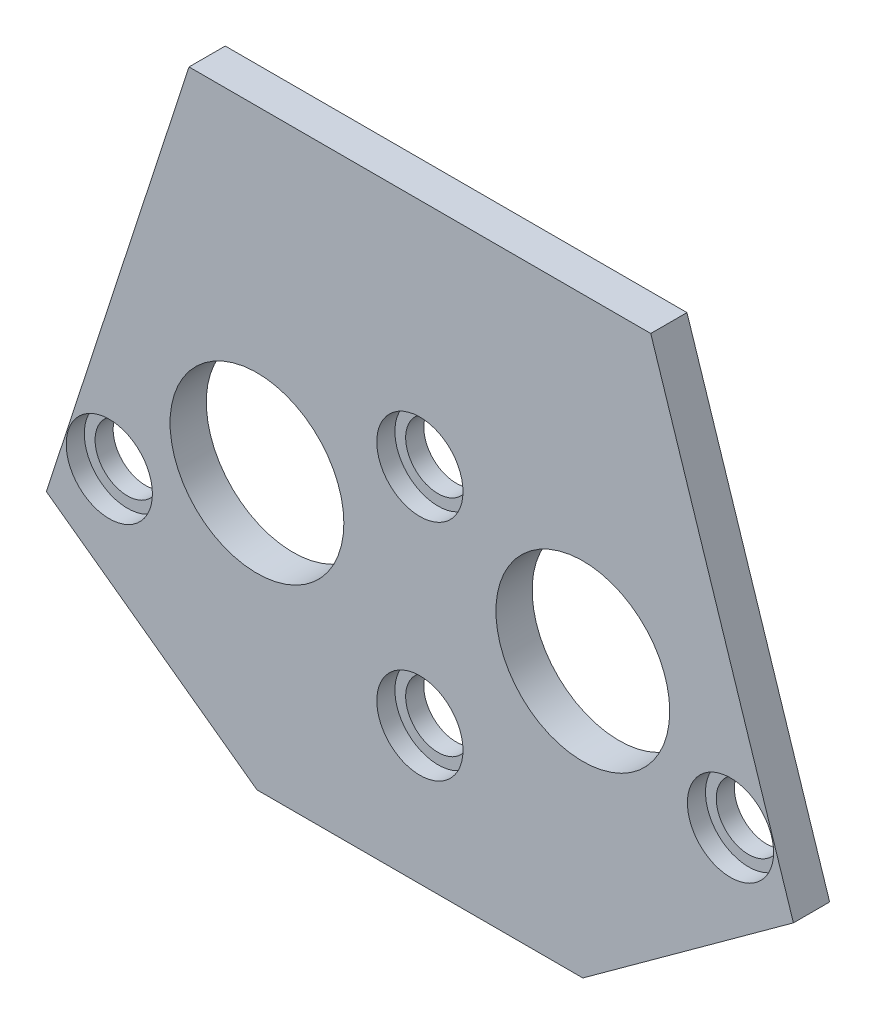
ISO-10303-21;
HEADER;
FILE_DESCRIPTION(('STEP AP214'),'2;1');
FILE_NAME('part.step','',(''),(''),'','','');
FILE_SCHEMA(('AUTOMOTIVE_DESIGN { 1 0 10303 214 1 1 1 1 }'));
ENDSEC;
DATA;
#1=APPLICATION_CONTEXT('core data for automotive mechanical design processes');
#2=APPLICATION_PROTOCOL_DEFINITION('international standard','automotive_design',2000,#1);
#3=PRODUCT_CONTEXT('',#1,'mechanical');
#4=PRODUCT('Part','Part','',(#3));
#5=PRODUCT_RELATED_PRODUCT_CATEGORY('part','',(#4));
#6=PRODUCT_DEFINITION_FORMATION('','',#4);
#7=PRODUCT_DEFINITION_CONTEXT('part definition',#1,'design');
#8=PRODUCT_DEFINITION('design','',#6,#7);
#9=PRODUCT_DEFINITION_SHAPE('','',#8);
#10=(LENGTH_UNIT() NAMED_UNIT(*) SI_UNIT(.MILLI.,.METRE.));
#11=(NAMED_UNIT(*) PLANE_ANGLE_UNIT() SI_UNIT($,.RADIAN.));
#12=(NAMED_UNIT(*) SI_UNIT($,.STERADIAN.) SOLID_ANGLE_UNIT());
#13=UNCERTAINTY_MEASURE_WITH_UNIT(LENGTH_MEASURE(1.E-05),#10,'distance_accuracy_value','');
#14=(GEOMETRIC_REPRESENTATION_CONTEXT(3) GLOBAL_UNCERTAINTY_ASSIGNED_CONTEXT((#13)) GLOBAL_UNIT_ASSIGNED_CONTEXT((#10,
#11,#12)) REPRESENTATION_CONTEXT('',''));
#15=CARTESIAN_POINT('',(0.,0.,0.));
#16=DIRECTION('',(0.,0.,1.));
#17=DIRECTION('',(1.,0.,0.));
#18=AXIS2_PLACEMENT_3D('',#15,#16,#17);
#19=CARTESIAN_POINT('',(0.,0.,5.334));
#20=DIRECTION('',(0.,0.,-1.));
#21=DIRECTION('',(-1.,0.,0.));
#22=AXIS2_PLACEMENT_3D('',#19,#20,#21);
#23=CYLINDRICAL_SURFACE('',#22,4.76250000000001);
#24=CARTESIAN_POINT('',(0.,0.,0.));
#25=DIRECTION('',(0.,0.,1.));
#26=DIRECTION('',(1.,0.,0.));
#27=AXIS2_PLACEMENT_3D('',#24,#25,#26);
#28=CIRCLE('',#27,4.76250000000001);
#29=CARTESIAN_POINT('',(4.76250000000001,0.,0.));
#30=VERTEX_POINT('',#29);
#31=EDGE_CURVE('E126',#30,#30,#28,.T.);
#32=ORIENTED_EDGE('',*,*,#31,.F.);
#33=EDGE_LOOP('',(#32));
#34=FACE_BOUND('',#33,.T.);
#35=CARTESIAN_POINT('',(0.,0.,2.667));
#36=DIRECTION('',(0.,0.,1.));
#37=DIRECTION('',(1.,0.,0.));
#38=AXIS2_PLACEMENT_3D('',#35,#36,#37);
#39=CIRCLE('',#38,4.7625);
#40=CARTESIAN_POINT('',(4.7625,0.,2.667));
#41=VERTEX_POINT('',#40);
#42=EDGE_CURVE('E267',#41,#41,#39,.T.);
#43=ORIENTED_EDGE('',*,*,#42,.T.);
#44=EDGE_LOOP('',(#43));
#45=FACE_BOUND('',#44,.T.);
#46=ADVANCED_FACE('F34',(#34,#45),#23,.F.);
#47=CARTESIAN_POINT('',(-50.4535452255246,16.3933505885501,5.334));
#48=DIRECTION('',(0.951056516295157,-0.309016994374938,0.));
#49=DIRECTION('',(0.309016994374938,0.951056516295157,0.));
#50=AXIS2_PLACEMENT_3D('',#47,#48,#49);
#51=PLANE('',#50);
#52=DIRECTION('',(-0.309016994374938,-0.951056516295157,0.));
#53=VECTOR('',#52,1.);
#54=CARTESIAN_POINT('',(-50.4535452255246,16.3933505885501,0.));
#55=LINE('',#54,#53);
#56=CARTESIAN_POINT('',(-34.0059481811678,67.0138492380612,0.));
#57=VERTEX_POINT('',#56);
#58=CARTESIAN_POINT('',(-55.0227799767962,2.33069201707196,0.));
#59=VERTEX_POINT('',#58);
#60=EDGE_CURVE('E129',#57,#59,#55,.T.);
#61=ORIENTED_EDGE('',*,*,#60,.T.);
#62=DIRECTION('',(0.,0.,-1.));
#63=VECTOR('',#62,1.);
#64=CARTESIAN_POINT('',(-55.0227799767962,2.33069201707196,5.334));
#65=LINE('',#64,#63);
#66=CARTESIAN_POINT('',(-55.0227799767962,2.33069201707196,5.334));
#67=VERTEX_POINT('',#66);
#68=EDGE_CURVE('E11',#67,#59,#65,.T.);
#69=ORIENTED_EDGE('',*,*,#68,.F.);
#70=DIRECTION('',(-0.309016994374938,-0.951056516295157,0.));
#71=VECTOR('',#70,1.);
#72=CARTESIAN_POINT('',(-50.4535452255246,16.3933505885501,5.334));
#73=LINE('',#72,#71);
#74=CARTESIAN_POINT('',(-34.0059481811678,67.0138492380612,5.334));
#75=VERTEX_POINT('',#74);
#76=EDGE_CURVE('E153',#75,#67,#73,.T.);
#77=ORIENTED_EDGE('',*,*,#76,.F.);
#78=DIRECTION('',(0.,0.,-1.));
#79=VECTOR('',#78,1.);
#80=CARTESIAN_POINT('',(-34.0059481811678,67.0138492380612,5.334));
#81=LINE('',#80,#79);
#82=EDGE_CURVE('E115',#75,#57,#81,.T.);
#83=ORIENTED_EDGE('',*,*,#82,.T.);
#84=EDGE_LOOP('',(#61,#69,#77,#83));
#85=FACE_BOUND('',#84,.T.);
#86=ADVANCED_FACE('F151',(#85),#51,.F.);
#87=CARTESIAN_POINT('',(-17.9015930279491,-24.6394289913025,5.334));
#88=DIRECTION('',(0.587785252292465,0.809016994374953,0.));
#89=DIRECTION('',(-0.809016994374953,0.587785252292465,0.));
#90=AXIS2_PLACEMENT_3D('',#87,#88,#89);
#91=PLANE('',#90);
#92=DIRECTION('',(0.809016994374953,-0.587785252292465,0.));
#93=VECTOR('',#92,1.);
#94=CARTESIAN_POINT('',(-17.9015930279491,-24.6394289913025,0.));
#95=LINE('',#94,#93);
#96=CARTESIAN_POINT('',(-24.,-20.2086769730233,0.));
#97=VERTEX_POINT('',#96);
#98=EDGE_CURVE('E132',#59,#97,#95,.T.);
#99=ORIENTED_EDGE('',*,*,#98,.T.);
#100=DIRECTION('',(0.,0.,-1.));
#101=VECTOR('',#100,1.);
#102=CARTESIAN_POINT('',(-24.,-20.2086769730233,5.334));
#103=LINE('',#102,#101);
#104=CARTESIAN_POINT('',(-24.,-20.2086769730233,5.334));
#105=VERTEX_POINT('',#104);
#106=EDGE_CURVE('E43',#105,#97,#103,.T.);
#107=ORIENTED_EDGE('',*,*,#106,.F.);
#108=DIRECTION('',(0.809016994374953,-0.587785252292465,0.));
#109=VECTOR('',#108,1.);
#110=CARTESIAN_POINT('',(-17.9015930279491,-24.6394289913025,5.334));
#111=LINE('',#110,#109);
#112=EDGE_CURVE('E88',#67,#105,#111,.T.);
#113=ORIENTED_EDGE('',*,*,#112,.F.);
#114=ORIENTED_EDGE('',*,*,#68,.T.);
#115=EDGE_LOOP('',(#99,#107,#113,#114));
#116=FACE_BOUND('',#115,.T.);
#117=ADVANCED_FACE('F173',(#116),#91,.F.);
#118=CARTESIAN_POINT('',(0.,-20.2086769730233,5.334));
#119=DIRECTION('',(0.,1.,0.));
#120=DIRECTION('',(0.,0.,1.));
#121=AXIS2_PLACEMENT_3D('',#118,#119,#120);
#122=PLANE('',#121);
#123=DIRECTION('',(1.,0.,0.));
#124=VECTOR('',#123,1.);
#125=CARTESIAN_POINT('',(0.,-20.2086769730233,0.));
#126=LINE('',#125,#124);
#127=CARTESIAN_POINT('',(24.,-20.2086769730233,0.));
#128=VERTEX_POINT('',#127);
#129=EDGE_CURVE('E134',#97,#128,#126,.T.);
#130=ORIENTED_EDGE('',*,*,#129,.T.);
#131=DIRECTION('',(0.,0.,-1.));
#132=VECTOR('',#131,1.);
#133=CARTESIAN_POINT('',(24.,-20.2086769730233,5.334));
#134=LINE('',#133,#132);
#135=CARTESIAN_POINT('',(24.,-20.2086769730233,5.334));
#136=VERTEX_POINT('',#135);
#137=EDGE_CURVE('E110',#136,#128,#134,.T.);
#138=ORIENTED_EDGE('',*,*,#137,.F.);
#139=DIRECTION('',(1.,0.,0.));
#140=VECTOR('',#139,1.);
#141=CARTESIAN_POINT('',(0.,-20.2086769730233,5.334));
#142=LINE('',#141,#140);
#143=EDGE_CURVE('E101',#105,#136,#142,.T.);
#144=ORIENTED_EDGE('',*,*,#143,.F.);
#145=ORIENTED_EDGE('',*,*,#106,.T.);
#146=EDGE_LOOP('',(#130,#138,#144,#145));
#147=FACE_BOUND('',#146,.T.);
#148=ADVANCED_FACE('F145',(#147),#122,.F.);
#149=CARTESIAN_POINT('',(17.9015930279497,-24.6394289913023,5.334));
#150=DIRECTION('',(-0.587785252292481,0.809016994374941,0.));
#151=DIRECTION('',(-0.809016994374941,-0.587785252292481,0.));
#152=AXIS2_PLACEMENT_3D('',#149,#150,#151);
#153=PLANE('',#152);
#154=DIRECTION('',(0.809016994374941,0.587785252292481,0.));
#155=VECTOR('',#154,1.);
#156=CARTESIAN_POINT('',(17.9015930279497,-24.6394289913023,0.));
#157=LINE('',#156,#155);
#158=CARTESIAN_POINT('',(55.0227799767966,2.33069201707308,0.));
#159=VERTEX_POINT('',#158);
#160=EDGE_CURVE('E109',#128,#159,#157,.T.);
#161=ORIENTED_EDGE('',*,*,#160,.T.);
#162=DIRECTION('',(0.,0.,-1.));
#163=VECTOR('',#162,1.);
#164=CARTESIAN_POINT('',(55.0227799767966,2.33069201707308,5.334));
#165=LINE('',#164,#163);
#166=CARTESIAN_POINT('',(55.0227799767966,2.33069201707308,5.334));
#167=VERTEX_POINT('',#166);
#168=EDGE_CURVE('E106',#167,#159,#165,.T.);
#169=ORIENTED_EDGE('',*,*,#168,.F.);
#170=DIRECTION('',(0.809016994374941,0.587785252292481,0.));
#171=VECTOR('',#170,1.);
#172=CARTESIAN_POINT('',(17.9015930279497,-24.6394289913023,5.334));
#173=LINE('',#172,#171);
#174=EDGE_CURVE('E95',#136,#167,#173,.T.);
#175=ORIENTED_EDGE('',*,*,#174,.F.);
#176=ORIENTED_EDGE('',*,*,#137,.T.);
#177=EDGE_LOOP('',(#161,#169,#175,#176));
#178=FACE_BOUND('',#177,.T.);
#179=ADVANCED_FACE('F107',(#178),#153,.F.);
#180=CARTESIAN_POINT('',(50.4535452255246,16.3933505885512,5.334));
#181=DIRECTION('',(-0.951056516295151,-0.309016994374957,0.));
#182=DIRECTION('',(0.309016994374957,-0.951056516295151,0.));
#183=AXIS2_PLACEMENT_3D('',#180,#181,#182);
#184=PLANE('',#183);
#185=DIRECTION('',(-0.309016994374957,0.951056516295151,0.));
#186=VECTOR('',#185,1.);
#187=CARTESIAN_POINT('',(50.4535452255246,16.3933505885512,0.));
#188=LINE('',#187,#186);
#189=CARTESIAN_POINT('',(34.0059481811668,67.0138492380619,0.));
#190=VERTEX_POINT('',#189);
#191=EDGE_CURVE('E74',#159,#190,#188,.T.);
#192=ORIENTED_EDGE('',*,*,#191,.T.);
#193=DIRECTION('',(0.,0.,-1.));
#194=VECTOR('',#193,1.);
#195=CARTESIAN_POINT('',(34.0059481811668,67.0138492380619,5.334));
#196=LINE('',#195,#194);
#197=CARTESIAN_POINT('',(34.0059481811668,67.0138492380619,5.334));
#198=VERTEX_POINT('',#197);
#199=EDGE_CURVE('E111',#198,#190,#196,.T.);
#200=ORIENTED_EDGE('',*,*,#199,.F.);
#201=DIRECTION('',(-0.309016994374957,0.951056516295151,0.));
#202=VECTOR('',#201,1.);
#203=CARTESIAN_POINT('',(50.4535452255246,16.3933505885512,5.334));
#204=LINE('',#203,#202);
#205=EDGE_CURVE('E99',#167,#198,#204,.T.);
#206=ORIENTED_EDGE('',*,*,#205,.F.);
#207=ORIENTED_EDGE('',*,*,#168,.T.);
#208=EDGE_LOOP('',(#192,#200,#206,#207));
#209=FACE_BOUND('',#208,.T.);
#210=ADVANCED_FACE('F113',(#209),#184,.F.);
#211=CARTESIAN_POINT('',(24.,20.2086769730232,5.334));
#212=DIRECTION('',(0.,0.,-1.));
#213=DIRECTION('',(-1.,0.,0.));
#214=AXIS2_PLACEMENT_3D('',#211,#212,#213);
#215=CYLINDRICAL_SURFACE('',#214,12.8);
#216=CARTESIAN_POINT('',(24.,20.2086769730232,5.334));
#217=DIRECTION('',(0.,0.,1.));
#218=DIRECTION('',(1.,0.,0.));
#219=AXIS2_PLACEMENT_3D('',#216,#217,#218);
#220=CIRCLE('',#219,12.8);
#221=CARTESIAN_POINT('',(36.8,20.2086769730232,5.334));
#222=VERTEX_POINT('',#221);
#223=EDGE_CURVE('E186',#222,#222,#220,.T.);
#224=ORIENTED_EDGE('',*,*,#223,.T.);
#225=EDGE_LOOP('',(#224));
#226=FACE_BOUND('',#225,.T.);
#227=CARTESIAN_POINT('',(24.,20.2086769730232,0.));
#228=DIRECTION('',(0.,0.,1.));
#229=DIRECTION('',(1.,0.,0.));
#230=AXIS2_PLACEMENT_3D('',#227,#228,#229);
#231=CIRCLE('',#230,12.8);
#232=CARTESIAN_POINT('',(36.8,20.2086769730232,0.));
#233=VERTEX_POINT('',#232);
#234=EDGE_CURVE('E122',#233,#233,#231,.T.);
#235=ORIENTED_EDGE('',*,*,#234,.F.);
#236=EDGE_LOOP('',(#235));
#237=FACE_BOUND('',#236,.T.);
#238=ADVANCED_FACE('F163',(#226,#237),#215,.F.);
#239=CARTESIAN_POINT('',(-24.,20.2086769730232,5.334));
#240=DIRECTION('',(0.,0.,-1.));
#241=DIRECTION('',(-1.,0.,0.));
#242=AXIS2_PLACEMENT_3D('',#239,#240,#241);
#243=CYLINDRICAL_SURFACE('',#242,12.8);
#244=CARTESIAN_POINT('',(-24.,20.2086769730232,5.334));
#245=DIRECTION('',(0.,0.,1.));
#246=DIRECTION('',(1.,0.,0.));
#247=AXIS2_PLACEMENT_3D('',#244,#245,#246);
#248=CIRCLE('',#247,12.8);
#249=CARTESIAN_POINT('',(-11.2,20.2086769730232,5.334));
#250=VERTEX_POINT('',#249);
#251=EDGE_CURVE('E139',#250,#250,#248,.T.);
#252=ORIENTED_EDGE('',*,*,#251,.T.);
#253=EDGE_LOOP('',(#252));
#254=FACE_BOUND('',#253,.T.);
#255=CARTESIAN_POINT('',(-24.,20.2086769730232,0.));
#256=DIRECTION('',(0.,0.,1.));
#257=DIRECTION('',(1.,0.,0.));
#258=AXIS2_PLACEMENT_3D('',#255,#256,#257);
#259=CIRCLE('',#258,12.8);
#260=CARTESIAN_POINT('',(-11.2,20.2086769730232,0.));
#261=VERTEX_POINT('',#260);
#262=EDGE_CURVE('E119',#261,#261,#259,.T.);
#263=ORIENTED_EDGE('',*,*,#262,.F.);
#264=EDGE_LOOP('',(#263));
#265=FACE_BOUND('',#264,.T.);
#266=ADVANCED_FACE('F36',(#254,#265),#243,.F.);
#267=CARTESIAN_POINT('',(-6.97380980567866E-13,67.0138492380615,5.334));
#268=DIRECTION('',(0.,-1.,0.));
#269=DIRECTION('',(1.,0.,0.));
#270=AXIS2_PLACEMENT_3D('',#267,#268,#269);
#271=PLANE('',#270);
#272=DIRECTION('',(-1.,0.,0.));
#273=VECTOR('',#272,1.);
#274=CARTESIAN_POINT('',(-6.97380980567866E-13,67.0138492380615,0.));
#275=LINE('',#274,#273);
#276=EDGE_CURVE('E80',#190,#57,#275,.T.);
#277=ORIENTED_EDGE('',*,*,#276,.T.);
#278=ORIENTED_EDGE('',*,*,#82,.F.);
#279=DIRECTION('',(-1.,0.,0.));
#280=VECTOR('',#279,1.);
#281=CARTESIAN_POINT('',(-6.97380980567866E-13,67.0138492380615,5.334));
#282=LINE('',#281,#280);
#283=EDGE_CURVE('E51',#198,#75,#282,.T.);
#284=ORIENTED_EDGE('',*,*,#283,.F.);
#285=ORIENTED_EDGE('',*,*,#199,.T.);
#286=EDGE_LOOP('',(#277,#278,#284,#285));
#287=FACE_BOUND('',#286,.T.);
#288=ADVANCED_FACE('F154',(#287),#271,.F.);
#289=CARTESIAN_POINT('',(0.,0.,5.334));
#290=DIRECTION('',(0.,0.,1.));
#291=DIRECTION('',(1.,0.,0.));
#292=AXIS2_PLACEMENT_3D('',#289,#290,#291);
#293=PLANE('',#292);
#294=CARTESIAN_POINT('',(-45.7516796693192,9.84884506070272,5.334));
#295=DIRECTION('',(0.,0.,1.));
#296=DIRECTION('',(1.,0.,0.));
#297=AXIS2_PLACEMENT_3D('',#294,#295,#296);
#298=CIRCLE('',#297,6.35);
#299=CARTESIAN_POINT('',(-39.4016796693192,9.84884506070272,5.334));
#300=VERTEX_POINT('',#299);
#301=EDGE_CURVE('E263',#300,#300,#298,.T.);
#302=ORIENTED_EDGE('',*,*,#301,.F.);
#303=EDGE_LOOP('',(#302));
#304=FACE_BOUND('',#303,.T.);
#305=CARTESIAN_POINT('',(0.,33.0086769730232,5.334));
#306=DIRECTION('',(0.,0.,1.));
#307=DIRECTION('',(1.,0.,0.));
#308=AXIS2_PLACEMENT_3D('',#305,#306,#307);
#309=CIRCLE('',#308,6.35);
#310=CARTESIAN_POINT('',(6.35,33.0086769730232,5.334));
#311=VERTEX_POINT('',#310);
#312=EDGE_CURVE('E274',#311,#311,#309,.T.);
#313=ORIENTED_EDGE('',*,*,#312,.F.);
#314=EDGE_LOOP('',(#313));
#315=FACE_BOUND('',#314,.T.);
#316=CARTESIAN_POINT('',(45.7516796693194,9.84884506070348,5.334));
#317=DIRECTION('',(0.,0.,1.));
#318=DIRECTION('',(1.,0.,0.));
#319=AXIS2_PLACEMENT_3D('',#316,#317,#318);
#320=CIRCLE('',#319,6.35);
#321=CARTESIAN_POINT('',(52.1016796693194,9.84884506070348,5.334));
#322=VERTEX_POINT('',#321);
#323=EDGE_CURVE('E268',#322,#322,#320,.T.);
#324=ORIENTED_EDGE('',*,*,#323,.F.);
#325=EDGE_LOOP('',(#324));
#326=FACE_BOUND('',#325,.T.);
#327=CARTESIAN_POINT('',(0.,0.,5.334));
#328=DIRECTION('',(0.,0.,1.));
#329=DIRECTION('',(1.,0.,0.));
#330=AXIS2_PLACEMENT_3D('',#327,#328,#329);
#331=CIRCLE('',#330,6.35);
#332=CARTESIAN_POINT('',(6.35,0.,5.334));
#333=VERTEX_POINT('',#332);
#334=EDGE_CURVE('E284',#333,#333,#331,.T.);
#335=ORIENTED_EDGE('',*,*,#334,.F.);
#336=EDGE_LOOP('',(#335));
#337=FACE_BOUND('',#336,.T.);
#338=ORIENTED_EDGE('',*,*,#251,.F.);
#339=EDGE_LOOP('',(#338));
#340=FACE_BOUND('',#339,.T.);
#341=ORIENTED_EDGE('',*,*,#223,.F.);
#342=EDGE_LOOP('',(#341));
#343=FACE_BOUND('',#342,.T.);
#344=ORIENTED_EDGE('',*,*,#76,.T.);
#345=ORIENTED_EDGE('',*,*,#112,.T.);
#346=ORIENTED_EDGE('',*,*,#143,.T.);
#347=ORIENTED_EDGE('',*,*,#174,.T.);
#348=ORIENTED_EDGE('',*,*,#205,.T.);
#349=ORIENTED_EDGE('',*,*,#283,.T.);
#350=EDGE_LOOP('',(#344,#345,#346,#347,#348,#349));
#351=FACE_BOUND('',#350,.T.);
#352=ADVANCED_FACE('F97',(#304,#315,#326,#337,#340,#343,#351),#293,.T.);
#353=CARTESIAN_POINT('',(0.,0.,0.));
#354=DIRECTION('',(0.,0.,1.));
#355=DIRECTION('',(1.,0.,0.));
#356=AXIS2_PLACEMENT_3D('',#353,#354,#355);
#357=PLANE('',#356);
#358=CARTESIAN_POINT('',(-45.7516796693192,9.84884506070272,0.));
#359=DIRECTION('',(0.,0.,1.));
#360=DIRECTION('',(1.,0.,0.));
#361=AXIS2_PLACEMENT_3D('',#358,#359,#360);
#362=CIRCLE('',#361,4.7625);
#363=CARTESIAN_POINT('',(-40.9891796693192,9.84884506070272,0.));
#364=VERTEX_POINT('',#363);
#365=EDGE_CURVE('E247',#364,#364,#362,.T.);
#366=ORIENTED_EDGE('',*,*,#365,.T.);
#367=EDGE_LOOP('',(#366));
#368=FACE_BOUND('',#367,.T.);
#369=CARTESIAN_POINT('',(0.,33.0086769730232,0.));
#370=DIRECTION('',(0.,0.,1.));
#371=DIRECTION('',(1.,0.,0.));
#372=AXIS2_PLACEMENT_3D('',#369,#370,#371);
#373=CIRCLE('',#372,4.76250000000001);
#374=CARTESIAN_POINT('',(4.7625,33.0086769730232,0.));
#375=VERTEX_POINT('',#374);
#376=EDGE_CURVE('E248',#375,#375,#373,.T.);
#377=ORIENTED_EDGE('',*,*,#376,.T.);
#378=EDGE_LOOP('',(#377));
#379=FACE_BOUND('',#378,.T.);
#380=CARTESIAN_POINT('',(45.7516796693194,9.84884506070348,0.));
#381=DIRECTION('',(0.,0.,1.));
#382=DIRECTION('',(1.,0.,0.));
#383=AXIS2_PLACEMENT_3D('',#380,#381,#382);
#384=CIRCLE('',#383,4.7625);
#385=CARTESIAN_POINT('',(50.5141796693194,9.84884506070348,0.));
#386=VERTEX_POINT('',#385);
#387=EDGE_CURVE('E253',#386,#386,#384,.T.);
#388=ORIENTED_EDGE('',*,*,#387,.T.);
#389=EDGE_LOOP('',(#388));
#390=FACE_BOUND('',#389,.T.);
#391=ORIENTED_EDGE('',*,*,#262,.T.);
#392=EDGE_LOOP('',(#391));
#393=FACE_BOUND('',#392,.T.);
#394=ORIENTED_EDGE('',*,*,#234,.T.);
#395=EDGE_LOOP('',(#394));
#396=FACE_BOUND('',#395,.T.);
#397=ORIENTED_EDGE('',*,*,#31,.T.);
#398=EDGE_LOOP('',(#397));
#399=FACE_BOUND('',#398,.T.);
#400=ORIENTED_EDGE('',*,*,#60,.F.);
#401=ORIENTED_EDGE('',*,*,#276,.F.);
#402=ORIENTED_EDGE('',*,*,#191,.F.);
#403=ORIENTED_EDGE('',*,*,#160,.F.);
#404=ORIENTED_EDGE('',*,*,#129,.F.);
#405=ORIENTED_EDGE('',*,*,#98,.F.);
#406=EDGE_LOOP('',(#400,#401,#402,#403,#404,#405));
#407=FACE_BOUND('',#406,.T.);
#408=ADVANCED_FACE('F148',(#368,#379,#390,#393,#396,#399,#407),#357,.F.);
#409=CARTESIAN_POINT('',(0.,0.,2.667));
#410=DIRECTION('',(0.,0.,1.));
#411=DIRECTION('',(1.,0.,0.));
#412=AXIS2_PLACEMENT_3D('',#409,#410,#411);
#413=CYLINDRICAL_SURFACE('',#412,6.35);
#414=CARTESIAN_POINT('',(0.,0.,2.667));
#415=DIRECTION('',(0.,0.,1.));
#416=DIRECTION('',(1.,0.,0.));
#417=AXIS2_PLACEMENT_3D('',#414,#415,#416);
#418=CIRCLE('',#417,6.35);
#419=CARTESIAN_POINT('',(6.35,0.,2.667));
#420=VERTEX_POINT('',#419);
#421=EDGE_CURVE('E123',#420,#420,#418,.T.);
#422=ORIENTED_EDGE('',*,*,#421,.F.);
#423=EDGE_LOOP('',(#422));
#424=FACE_BOUND('',#423,.T.);
#425=ORIENTED_EDGE('',*,*,#334,.T.);
#426=EDGE_LOOP('',(#425));
#427=FACE_BOUND('',#426,.T.);
#428=ADVANCED_FACE('F191',(#424,#427),#413,.F.);
#429=CARTESIAN_POINT('',(0.,0.,2.667));
#430=DIRECTION('',(0.,0.,1.));
#431=DIRECTION('',(1.,0.,0.));
#432=AXIS2_PLACEMENT_3D('',#429,#430,#431);
#433=PLANE('',#432);
#434=ORIENTED_EDGE('',*,*,#42,.F.);
#435=EDGE_LOOP('',(#434));
#436=FACE_BOUND('',#435,.T.);
#437=ORIENTED_EDGE('',*,*,#421,.T.);
#438=EDGE_LOOP('',(#437));
#439=FACE_BOUND('',#438,.T.);
#440=ADVANCED_FACE('F196',(#436,#439),#433,.T.);
#441=CARTESIAN_POINT('',(45.7516796693194,9.84884506070348,2.667));
#442=DIRECTION('',(0.,0.,1.));
#443=DIRECTION('',(1.,0.,0.));
#444=AXIS2_PLACEMENT_3D('',#441,#442,#443);
#445=CYLINDRICAL_SURFACE('',#444,6.35);
#446=CARTESIAN_POINT('',(45.7516796693194,9.84884506070348,2.667));
#447=DIRECTION('',(0.,0.,1.));
#448=DIRECTION('',(1.,0.,0.));
#449=AXIS2_PLACEMENT_3D('',#446,#447,#448);
#450=CIRCLE('',#449,6.35);
#451=CARTESIAN_POINT('',(52.1016796693194,9.84884506070348,2.667));
#452=VERTEX_POINT('',#451);
#453=EDGE_CURVE('E264',#452,#452,#450,.T.);
#454=ORIENTED_EDGE('',*,*,#453,.F.);
#455=EDGE_LOOP('',(#454));
#456=FACE_BOUND('',#455,.T.);
#457=ORIENTED_EDGE('',*,*,#323,.T.);
#458=EDGE_LOOP('',(#457));
#459=FACE_BOUND('',#458,.T.);
#460=ADVANCED_FACE('F204',(#456,#459),#445,.F.);
#461=CARTESIAN_POINT('',(45.7516796693194,9.84884506070348,2.667));
#462=DIRECTION('',(0.,0.,1.));
#463=DIRECTION('',(1.,0.,0.));
#464=AXIS2_PLACEMENT_3D('',#461,#462,#463);
#465=PLANE('',#464);
#466=CARTESIAN_POINT('',(45.7516796693194,9.84884506070348,2.667));
#467=DIRECTION('',(0.,0.,1.));
#468=DIRECTION('',(1.,0.,0.));
#469=AXIS2_PLACEMENT_3D('',#466,#467,#468);
#470=CIRCLE('',#469,4.7625);
#471=CARTESIAN_POINT('',(50.5141796693194,9.84884506070348,2.667));
#472=VERTEX_POINT('',#471);
#473=EDGE_CURVE('E260',#472,#472,#470,.T.);
#474=ORIENTED_EDGE('',*,*,#473,.F.);
#475=EDGE_LOOP('',(#474));
#476=FACE_BOUND('',#475,.T.);
#477=ORIENTED_EDGE('',*,*,#453,.T.);
#478=EDGE_LOOP('',(#477));
#479=FACE_BOUND('',#478,.T.);
#480=ADVANCED_FACE('F219',(#476,#479),#465,.T.);
#481=CARTESIAN_POINT('',(0.,33.0086769730232,2.667));
#482=DIRECTION('',(0.,0.,1.));
#483=DIRECTION('',(1.,0.,0.));
#484=AXIS2_PLACEMENT_3D('',#481,#482,#483);
#485=CYLINDRICAL_SURFACE('',#484,6.35);
#486=CARTESIAN_POINT('',(0.,33.0086769730232,2.667));
#487=DIRECTION('',(0.,0.,1.));
#488=DIRECTION('',(1.,0.,0.));
#489=AXIS2_PLACEMENT_3D('',#486,#487,#488);
#490=CIRCLE('',#489,6.35);
#491=CARTESIAN_POINT('',(6.35,33.0086769730232,2.667));
#492=VERTEX_POINT('',#491);
#493=EDGE_CURVE('E271',#492,#492,#490,.T.);
#494=ORIENTED_EDGE('',*,*,#493,.F.);
#495=EDGE_LOOP('',(#494));
#496=FACE_BOUND('',#495,.T.);
#497=ORIENTED_EDGE('',*,*,#312,.T.);
#498=EDGE_LOOP('',(#497));
#499=FACE_BOUND('',#498,.T.);
#500=ADVANCED_FACE('F216',(#496,#499),#485,.F.);
#501=CARTESIAN_POINT('',(0.,33.0086769730232,2.667));
#502=DIRECTION('',(0.,0.,1.));
#503=DIRECTION('',(1.,0.,0.));
#504=AXIS2_PLACEMENT_3D('',#501,#502,#503);
#505=PLANE('',#504);
#506=CARTESIAN_POINT('',(0.,33.0086769730232,2.667));
#507=DIRECTION('',(0.,0.,1.));
#508=DIRECTION('',(1.,0.,0.));
#509=AXIS2_PLACEMENT_3D('',#506,#507,#508);
#510=CIRCLE('',#509,4.76250000000001);
#511=CARTESIAN_POINT('',(4.7625,33.0086769730232,2.667));
#512=VERTEX_POINT('',#511);
#513=EDGE_CURVE('E250',#512,#512,#510,.T.);
#514=ORIENTED_EDGE('',*,*,#513,.F.);
#515=EDGE_LOOP('',(#514));
#516=FACE_BOUND('',#515,.T.);
#517=ORIENTED_EDGE('',*,*,#493,.T.);
#518=EDGE_LOOP('',(#517));
#519=FACE_BOUND('',#518,.T.);
#520=ADVANCED_FACE('F210',(#516,#519),#505,.T.);
#521=CARTESIAN_POINT('',(-45.7516796693192,9.84884506070272,2.667));
#522=DIRECTION('',(0.,0.,1.));
#523=DIRECTION('',(1.,0.,0.));
#524=AXIS2_PLACEMENT_3D('',#521,#522,#523);
#525=CYLINDRICAL_SURFACE('',#524,6.35);
#526=CARTESIAN_POINT('',(-45.7516796693192,9.84884506070272,2.667));
#527=DIRECTION('',(0.,0.,1.));
#528=DIRECTION('',(1.,0.,0.));
#529=AXIS2_PLACEMENT_3D('',#526,#527,#528);
#530=CIRCLE('',#529,6.35);
#531=CARTESIAN_POINT('',(-39.4016796693192,9.84884506070272,2.667));
#532=VERTEX_POINT('',#531);
#533=EDGE_CURVE('E277',#532,#532,#530,.T.);
#534=ORIENTED_EDGE('',*,*,#533,.F.);
#535=EDGE_LOOP('',(#534));
#536=FACE_BOUND('',#535,.T.);
#537=ORIENTED_EDGE('',*,*,#301,.T.);
#538=EDGE_LOOP('',(#537));
#539=FACE_BOUND('',#538,.T.);
#540=ADVANCED_FACE('F206',(#536,#539),#525,.F.);
#541=CARTESIAN_POINT('',(-45.7516796693192,9.84884506070272,2.667));
#542=DIRECTION('',(0.,0.,1.));
#543=DIRECTION('',(1.,0.,0.));
#544=AXIS2_PLACEMENT_3D('',#541,#542,#543);
#545=PLANE('',#544);
#546=CARTESIAN_POINT('',(-45.7516796693192,9.84884506070272,2.667));
#547=DIRECTION('',(0.,0.,1.));
#548=DIRECTION('',(1.,0.,0.));
#549=AXIS2_PLACEMENT_3D('',#546,#547,#548);
#550=CIRCLE('',#549,4.7625);
#551=CARTESIAN_POINT('',(-40.9891796693192,9.84884506070272,2.667));
#552=VERTEX_POINT('',#551);
#553=EDGE_CURVE('E245',#552,#552,#550,.T.);
#554=ORIENTED_EDGE('',*,*,#553,.F.);
#555=EDGE_LOOP('',(#554));
#556=FACE_BOUND('',#555,.T.);
#557=ORIENTED_EDGE('',*,*,#533,.T.);
#558=EDGE_LOOP('',(#557));
#559=FACE_BOUND('',#558,.T.);
#560=ADVANCED_FACE('F209',(#556,#559),#545,.T.);
#561=CARTESIAN_POINT('',(-45.7516796693192,9.84884506070272,0.));
#562=DIRECTION('',(0.,0.,1.));
#563=DIRECTION('',(1.,0.,0.));
#564=AXIS2_PLACEMENT_3D('',#561,#562,#563);
#565=CYLINDRICAL_SURFACE('',#564,4.7625);
#566=ORIENTED_EDGE('',*,*,#553,.T.);
#567=EDGE_LOOP('',(#566));
#568=FACE_BOUND('',#567,.T.);
#569=ORIENTED_EDGE('',*,*,#365,.F.);
#570=EDGE_LOOP('',(#569));
#571=FACE_BOUND('',#570,.T.);
#572=ADVANCED_FACE('F214',(#568,#571),#565,.F.);
#573=CARTESIAN_POINT('',(0.,33.0086769730232,0.));
#574=DIRECTION('',(0.,0.,1.));
#575=DIRECTION('',(1.,0.,0.));
#576=AXIS2_PLACEMENT_3D('',#573,#574,#575);
#577=CYLINDRICAL_SURFACE('',#576,4.76250000000001);
#578=ORIENTED_EDGE('',*,*,#513,.T.);
#579=EDGE_LOOP('',(#578));
#580=FACE_BOUND('',#579,.T.);
#581=ORIENTED_EDGE('',*,*,#376,.F.);
#582=EDGE_LOOP('',(#581));
#583=FACE_BOUND('',#582,.T.);
#584=ADVANCED_FACE('F233',(#580,#583),#577,.F.);
#585=CARTESIAN_POINT('',(45.7516796693194,9.84884506070348,0.));
#586=DIRECTION('',(0.,0.,1.));
#587=DIRECTION('',(1.,0.,0.));
#588=AXIS2_PLACEMENT_3D('',#585,#586,#587);
#589=CYLINDRICAL_SURFACE('',#588,4.7625);
#590=ORIENTED_EDGE('',*,*,#473,.T.);
#591=EDGE_LOOP('',(#590));
#592=FACE_BOUND('',#591,.T.);
#593=ORIENTED_EDGE('',*,*,#387,.F.);
#594=EDGE_LOOP('',(#593));
#595=FACE_BOUND('',#594,.T.);
#596=ADVANCED_FACE('F230',(#592,#595),#589,.F.);
#597=CLOSED_SHELL('',(#46,#86,#117,#148,#179,#210,#238,#266,#288,#352,#408,#428,#440,#460,#480,
#500,#520,#540,#560,#572,#584,#596));
#598=MANIFOLD_SOLID_BREP('B2',#597);
#599=ADVANCED_BREP_SHAPE_REPRESENTATION('',(#18,#598),#14);
#600=SHAPE_DEFINITION_REPRESENTATION(#9,#599);
ENDSEC;
END-ISO-10303-21;
